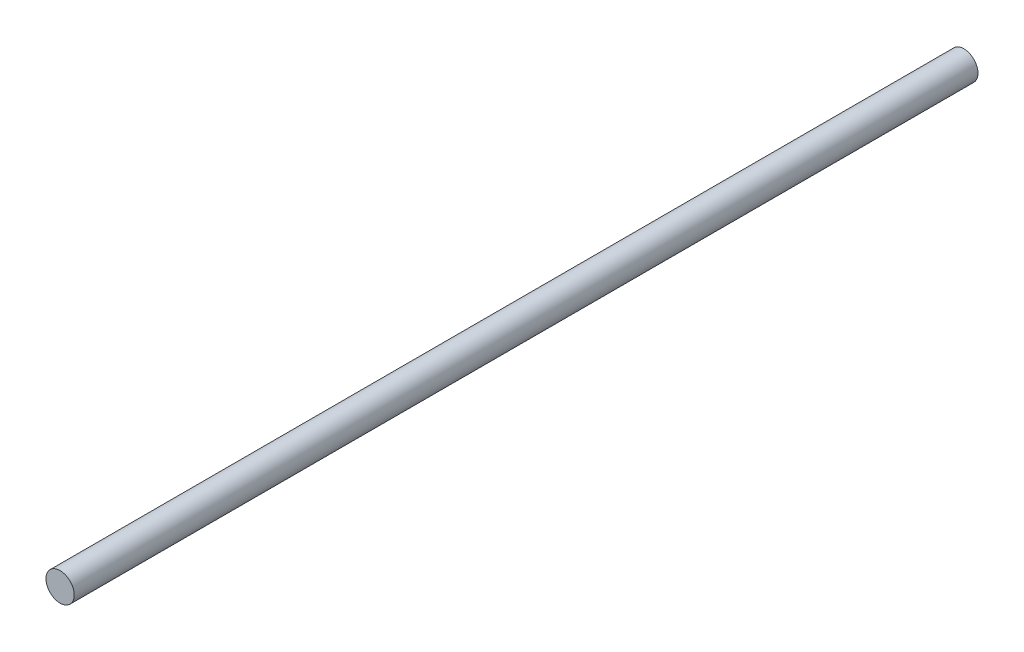
ISO-10303-21;
HEADER;
FILE_DESCRIPTION(('STEP AP214'),'2;1');
FILE_NAME('part.step','',(''),(''),'','','');
FILE_SCHEMA(('AUTOMOTIVE_DESIGN { 1 0 10303 214 1 1 1 1 }'));
ENDSEC;
DATA;
#1=APPLICATION_CONTEXT('core data for automotive mechanical design processes');
#2=APPLICATION_PROTOCOL_DEFINITION('international standard','automotive_design',2000,#1);
#3=PRODUCT_CONTEXT('',#1,'mechanical');
#4=PRODUCT('Part','Part','',(#3));
#5=PRODUCT_RELATED_PRODUCT_CATEGORY('part','',(#4));
#6=PRODUCT_DEFINITION_FORMATION('','',#4);
#7=PRODUCT_DEFINITION_CONTEXT('part definition',#1,'design');
#8=PRODUCT_DEFINITION('design','',#6,#7);
#9=PRODUCT_DEFINITION_SHAPE('','',#8);
#10=(LENGTH_UNIT() NAMED_UNIT(*) SI_UNIT(.MILLI.,.METRE.));
#11=(NAMED_UNIT(*) PLANE_ANGLE_UNIT() SI_UNIT($,.RADIAN.));
#12=(NAMED_UNIT(*) SI_UNIT($,.STERADIAN.) SOLID_ANGLE_UNIT());
#13=UNCERTAINTY_MEASURE_WITH_UNIT(LENGTH_MEASURE(1.E-05),#10,'distance_accuracy_value','');
#14=(GEOMETRIC_REPRESENTATION_CONTEXT(3) GLOBAL_UNCERTAINTY_ASSIGNED_CONTEXT((#13)) GLOBAL_UNIT_ASSIGNED_CONTEXT((#10,
#11,#12)) REPRESENTATION_CONTEXT('',''));
#15=CARTESIAN_POINT('',(0.,0.,0.));
#16=DIRECTION('',(0.,0.,1.));
#17=DIRECTION('',(1.,0.,0.));
#18=AXIS2_PLACEMENT_3D('',#15,#16,#17);
#19=CARTESIAN_POINT('',(-18.0817607368501,12.1069184528726,0.));
#20=DIRECTION('',(0.,0.,-1.));
#21=DIRECTION('',(-1.,0.,0.));
#22=AXIS2_PLACEMENT_3D('',#19,#20,#21);
#23=PLANE('',#22);
#24=CARTESIAN_POINT('',(-18.0817607368501,12.1069184528726,0.));
#25=DIRECTION('',(0.,0.,1.));
#26=DIRECTION('',(1.,0.,0.));
#27=AXIS2_PLACEMENT_3D('',#24,#25,#26);
#28=CIRCLE('',#27,3.175);
#29=CARTESIAN_POINT('',(-14.9067607368501,12.1069184528726,0.));
#30=VERTEX_POINT('',#29);
#31=EDGE_CURVE('E18',#30,#30,#28,.T.);
#32=ORIENTED_EDGE('',*,*,#31,.F.);
#33=EDGE_LOOP('',(#32));
#34=FACE_BOUND('',#33,.T.);
#35=ADVANCED_FACE('F15',(#34),#23,.T.);
#36=CARTESIAN_POINT('',(-18.0817607368501,12.1069184528726,203.2));
#37=DIRECTION('',(0.,0.,-1.));
#38=DIRECTION('',(-1.,0.,0.));
#39=AXIS2_PLACEMENT_3D('',#36,#37,#38);
#40=PLANE('',#39);
#41=CARTESIAN_POINT('',(-18.0817607368501,12.1069184528726,203.2));
#42=DIRECTION('',(0.,0.,1.));
#43=DIRECTION('',(1.,0.,0.));
#44=AXIS2_PLACEMENT_3D('',#41,#42,#43);
#45=CIRCLE('',#44,3.175);
#46=CARTESIAN_POINT('',(-14.9067607368501,12.1069184528726,203.2));
#47=VERTEX_POINT('',#46);
#48=EDGE_CURVE('E10',#47,#47,#45,.F.);
#49=ORIENTED_EDGE('',*,*,#48,.F.);
#50=EDGE_LOOP('',(#49));
#51=FACE_BOUND('',#50,.T.);
#52=ADVANCED_FACE('F30',(#51),#40,.F.);
#53=CARTESIAN_POINT('',(-18.0817607368501,12.1069184528726,0.));
#54=DIRECTION('',(0.,0.,1.));
#55=DIRECTION('',(1.,0.,0.));
#56=AXIS2_PLACEMENT_3D('',#53,#54,#55);
#57=CYLINDRICAL_SURFACE('',#56,3.175);
#58=ORIENTED_EDGE('',*,*,#48,.T.);
#59=EDGE_LOOP('',(#58));
#60=FACE_BOUND('',#59,.T.);
#61=ORIENTED_EDGE('',*,*,#31,.T.);
#62=EDGE_LOOP('',(#61));
#63=FACE_BOUND('',#62,.T.);
#64=ADVANCED_FACE('F27',(#60,#63),#57,.T.);
#65=CLOSED_SHELL('',(#35,#52,#64));
#66=MANIFOLD_SOLID_BREP('B1',#65);
#67=ADVANCED_BREP_SHAPE_REPRESENTATION('',(#18,#66),#14);
#68=SHAPE_DEFINITION_REPRESENTATION(#9,#67);
ENDSEC;
END-ISO-10303-21;
